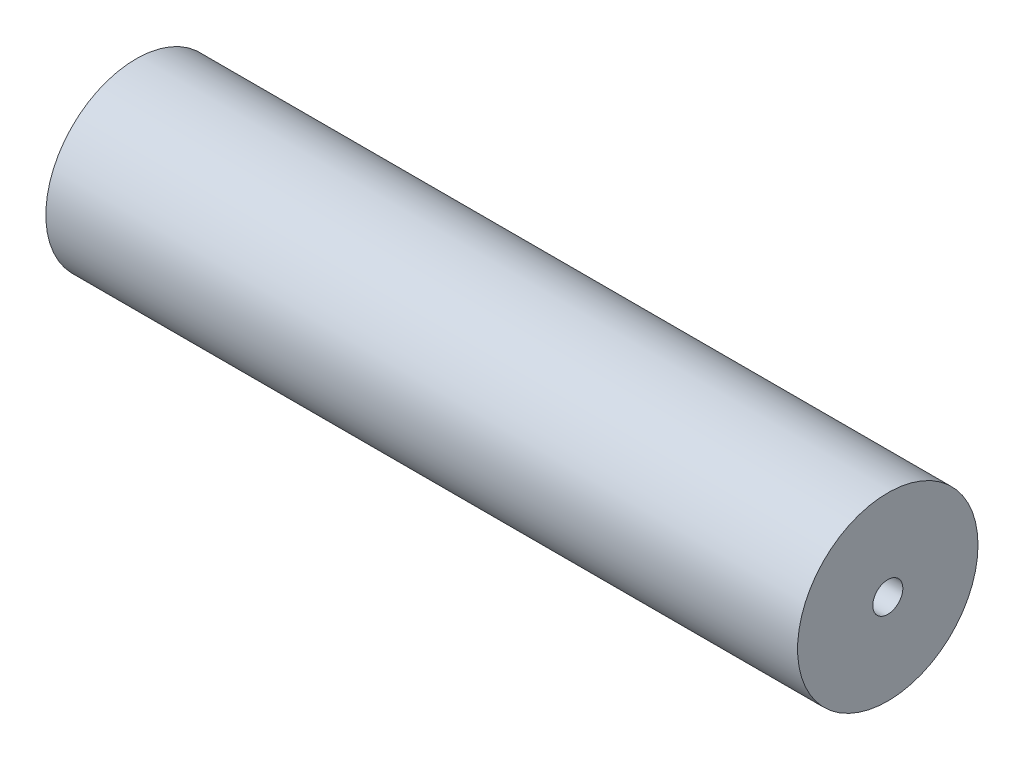
ISO-10303-21;
HEADER;
FILE_DESCRIPTION(('STEP AP214'),'2;1');
FILE_NAME('part.step','',(''),(''),'','','');
FILE_SCHEMA(('AUTOMOTIVE_DESIGN { 1 0 10303 214 1 1 1 1 }'));
ENDSEC;
DATA;
#1=APPLICATION_CONTEXT('core data for automotive mechanical design processes');
#2=APPLICATION_PROTOCOL_DEFINITION('international standard','automotive_design',2000,#1);
#3=PRODUCT_CONTEXT('',#1,'mechanical');
#4=PRODUCT('Part','Part','',(#3));
#5=PRODUCT_RELATED_PRODUCT_CATEGORY('part','',(#4));
#6=PRODUCT_DEFINITION_FORMATION('','',#4);
#7=PRODUCT_DEFINITION_CONTEXT('part definition',#1,'design');
#8=PRODUCT_DEFINITION('design','',#6,#7);
#9=PRODUCT_DEFINITION_SHAPE('','',#8);
#10=(LENGTH_UNIT() NAMED_UNIT(*) SI_UNIT(.MILLI.,.METRE.));
#11=(NAMED_UNIT(*) PLANE_ANGLE_UNIT() SI_UNIT($,.RADIAN.));
#12=(NAMED_UNIT(*) SI_UNIT($,.STERADIAN.) SOLID_ANGLE_UNIT());
#13=UNCERTAINTY_MEASURE_WITH_UNIT(LENGTH_MEASURE(1.E-05),#10,'distance_accuracy_value','');
#14=(GEOMETRIC_REPRESENTATION_CONTEXT(3) GLOBAL_UNCERTAINTY_ASSIGNED_CONTEXT((#13)) GLOBAL_UNIT_ASSIGNED_CONTEXT((#10,
#11,#12)) REPRESENTATION_CONTEXT('',''));
#15=CARTESIAN_POINT('',(0.,0.,0.));
#16=DIRECTION('',(0.,0.,1.));
#17=DIRECTION('',(1.,0.,0.));
#18=AXIS2_PLACEMENT_3D('',#15,#16,#17);
#19=CARTESIAN_POINT('',(250.,0.,0.));
#20=DIRECTION('',(1.,0.,0.));
#21=DIRECTION('',(0.,0.,-1.));
#22=AXIS2_PLACEMENT_3D('',#19,#20,#21);
#23=PLANE('',#22);
#24=CARTESIAN_POINT('',(250.,0.,0.));
#25=DIRECTION('',(1.,0.,0.));
#26=DIRECTION('',(0.,0.,-1.));
#27=AXIS2_PLACEMENT_3D('',#24,#25,#26);
#28=CIRCLE('',#27,30.);
#29=CARTESIAN_POINT('',(250.,0.,-30.));
#30=VERTEX_POINT('',#29);
#31=EDGE_CURVE('E10',#30,#30,#28,.T.);
#32=ORIENTED_EDGE('',*,*,#31,.T.);
#33=EDGE_LOOP('',(#32));
#34=FACE_BOUND('',#33,.T.);
#35=CARTESIAN_POINT('',(250.,0.,0.));
#36=DIRECTION('',(1.,0.,0.));
#37=DIRECTION('',(0.,0.,-1.));
#38=AXIS2_PLACEMENT_3D('',#35,#36,#37);
#39=CIRCLE('',#38,5.);
#40=CARTESIAN_POINT('',(250.,0.,-5.));
#41=VERTEX_POINT('',#40);
#42=EDGE_CURVE('E50',#41,#41,#39,.T.);
#43=ORIENTED_EDGE('',*,*,#42,.F.);
#44=EDGE_LOOP('',(#43));
#45=FACE_BOUND('',#44,.T.);
#46=ADVANCED_FACE('F37',(#34,#45),#23,.T.);
#47=CARTESIAN_POINT('',(0.,0.,0.));
#48=DIRECTION('',(1.,0.,0.));
#49=DIRECTION('',(0.,0.,-1.));
#50=AXIS2_PLACEMENT_3D('',#47,#48,#49);
#51=PLANE('',#50);
#52=CARTESIAN_POINT('',(0.,0.,0.));
#53=DIRECTION('',(1.,0.,0.));
#54=DIRECTION('',(0.,0.,-1.));
#55=AXIS2_PLACEMENT_3D('',#52,#53,#54);
#56=CIRCLE('',#55,30.);
#57=CARTESIAN_POINT('',(0.,0.,-30.));
#58=VERTEX_POINT('',#57);
#59=EDGE_CURVE('E41',#58,#58,#56,.T.);
#60=ORIENTED_EDGE('',*,*,#59,.F.);
#61=EDGE_LOOP('',(#60));
#62=FACE_BOUND('',#61,.T.);
#63=CARTESIAN_POINT('',(0.,0.,0.));
#64=DIRECTION('',(1.,0.,0.));
#65=DIRECTION('',(0.,0.,-1.));
#66=AXIS2_PLACEMENT_3D('',#63,#64,#65);
#67=CIRCLE('',#66,5.);
#68=CARTESIAN_POINT('',(0.,0.,-5.));
#69=VERTEX_POINT('',#68);
#70=EDGE_CURVE('E52',#69,#69,#67,.T.);
#71=ORIENTED_EDGE('',*,*,#70,.T.);
#72=EDGE_LOOP('',(#71));
#73=FACE_BOUND('',#72,.T.);
#74=ADVANCED_FACE('F64',(#62,#73),#51,.F.);
#75=CARTESIAN_POINT('',(250.,0.,0.));
#76=DIRECTION('',(-1.,0.,0.));
#77=DIRECTION('',(0.,0.,1.));
#78=AXIS2_PLACEMENT_3D('',#75,#76,#77);
#79=CYLINDRICAL_SURFACE('',#78,30.);
#80=ORIENTED_EDGE('',*,*,#31,.F.);
#81=EDGE_LOOP('',(#80));
#82=FACE_BOUND('',#81,.T.);
#83=ORIENTED_EDGE('',*,*,#59,.T.);
#84=EDGE_LOOP('',(#83));
#85=FACE_BOUND('',#84,.T.);
#86=ADVANCED_FACE('F39',(#82,#85),#79,.T.);
#87=CARTESIAN_POINT('',(250.,0.,0.));
#88=DIRECTION('',(-1.,0.,0.));
#89=DIRECTION('',(0.,0.,1.));
#90=AXIS2_PLACEMENT_3D('',#87,#88,#89);
#91=CYLINDRICAL_SURFACE('',#90,5.);
#92=ORIENTED_EDGE('',*,*,#42,.T.);
#93=EDGE_LOOP('',(#92));
#94=FACE_BOUND('',#93,.T.);
#95=ORIENTED_EDGE('',*,*,#70,.F.);
#96=EDGE_LOOP('',(#95));
#97=FACE_BOUND('',#96,.T.);
#98=ADVANCED_FACE('F60',(#94,#97),#91,.F.);
#99=CLOSED_SHELL('',(#46,#74,#86,#98));
#100=MANIFOLD_SOLID_BREP('B2',#99);
#101=ADVANCED_BREP_SHAPE_REPRESENTATION('',(#18,#100),#14);
#102=SHAPE_DEFINITION_REPRESENTATION(#9,#101);
ENDSEC;
END-ISO-10303-21;
